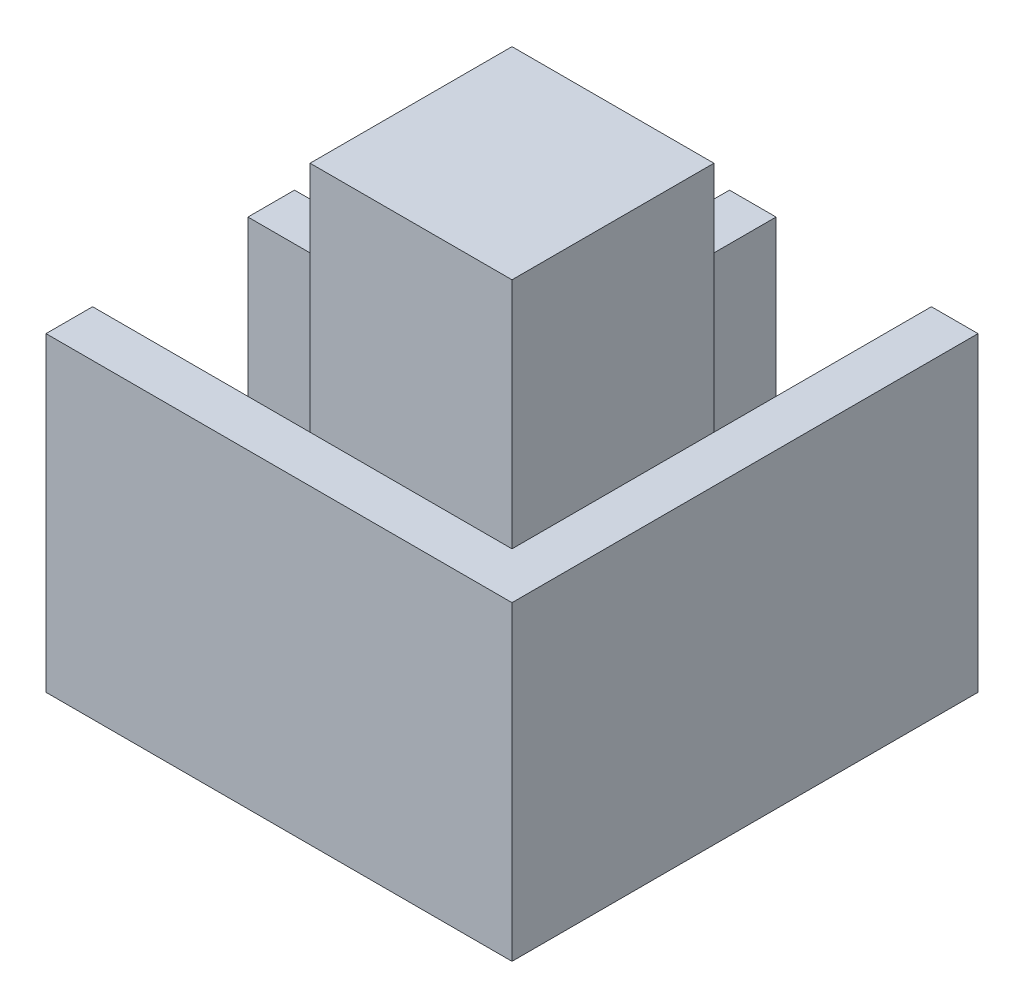
ISO-10303-21;
HEADER;
FILE_DESCRIPTION(('STEP AP214'),'2;1');
FILE_NAME('part.step','',(''),(''),'','','');
FILE_SCHEMA(('AUTOMOTIVE_DESIGN { 1 0 10303 214 1 1 1 1 }'));
ENDSEC;
DATA;
#1=APPLICATION_CONTEXT('core data for automotive mechanical design processes');
#2=APPLICATION_PROTOCOL_DEFINITION('international standard','automotive_design',2000,#1);
#3=PRODUCT_CONTEXT('',#1,'mechanical');
#4=PRODUCT('Part','Part','',(#3));
#5=PRODUCT_RELATED_PRODUCT_CATEGORY('part','',(#4));
#6=PRODUCT_DEFINITION_FORMATION('','',#4);
#7=PRODUCT_DEFINITION_CONTEXT('part definition',#1,'design');
#8=PRODUCT_DEFINITION('design','',#6,#7);
#9=PRODUCT_DEFINITION_SHAPE('','',#8);
#10=(LENGTH_UNIT() NAMED_UNIT(*) SI_UNIT(.MILLI.,.METRE.));
#11=(NAMED_UNIT(*) PLANE_ANGLE_UNIT() SI_UNIT($,.RADIAN.));
#12=(NAMED_UNIT(*) SI_UNIT($,.STERADIAN.) SOLID_ANGLE_UNIT());
#13=UNCERTAINTY_MEASURE_WITH_UNIT(LENGTH_MEASURE(1.E-05),#10,'distance_accuracy_value','');
#14=(GEOMETRIC_REPRESENTATION_CONTEXT(3) GLOBAL_UNCERTAINTY_ASSIGNED_CONTEXT((#13)) GLOBAL_UNIT_ASSIGNED_CONTEXT((#10,
#11,#12)) REPRESENTATION_CONTEXT('',''));
#15=CARTESIAN_POINT('',(0.,0.,0.));
#16=DIRECTION('',(0.,0.,1.));
#17=DIRECTION('',(1.,0.,0.));
#18=AXIS2_PLACEMENT_3D('',#15,#16,#17);
#19=CARTESIAN_POINT('',(0.,0.,0.));
#20=DIRECTION('',(0.,1.,0.));
#21=DIRECTION('',(0.,0.,1.));
#22=AXIS2_PLACEMENT_3D('',#19,#20,#21);
#23=PLANE('',#22);
#24=DIRECTION('',(0.,0.,-1.));
#25=VECTOR('',#24,1.);
#26=CARTESIAN_POINT('',(12.,0.,0.));
#27=LINE('',#26,#25);
#28=CARTESIAN_POINT('',(12.,0.,12.));
#29=VERTEX_POINT('',#28);
#30=CARTESIAN_POINT('',(12.,0.,-1.));
#31=VERTEX_POINT('',#30);
#32=EDGE_CURVE('E227',#29,#31,#27,.T.);
#33=ORIENTED_EDGE('',*,*,#32,.F.);
#34=DIRECTION('',(1.,0.,0.));
#35=VECTOR('',#34,1.);
#36=CARTESIAN_POINT('',(0.,0.,12.));
#37=LINE('',#36,#35);
#38=CARTESIAN_POINT('',(-1.,0.,12.));
#39=VERTEX_POINT('',#38);
#40=EDGE_CURVE('E248',#39,#29,#37,.T.);
#41=ORIENTED_EDGE('',*,*,#40,.F.);
#42=DIRECTION('',(-1.,0.,0.));
#43=VECTOR('',#42,1.);
#44=CARTESIAN_POINT('',(0.,0.,12.));
#45=LINE('',#44,#43);
#46=CARTESIAN_POINT('',(-15.,0.,12.));
#47=VERTEX_POINT('',#46);
#48=EDGE_CURVE('E284',#39,#47,#45,.T.);
#49=ORIENTED_EDGE('',*,*,#48,.T.);
#50=DIRECTION('',(0.,0.,-1.));
#51=VECTOR('',#50,1.);
#52=CARTESIAN_POINT('',(-15.,0.,0.));
#53=LINE('',#52,#51);
#54=CARTESIAN_POINT('',(-15.,0.,15.));
#55=VERTEX_POINT('',#54);
#56=EDGE_CURVE('E330',#55,#47,#53,.T.);
#57=ORIENTED_EDGE('',*,*,#56,.F.);
#58=DIRECTION('',(1.,0.,0.));
#59=VECTOR('',#58,1.);
#60=CARTESIAN_POINT('',(-15.,0.,15.));
#61=LINE('',#60,#59);
#62=CARTESIAN_POINT('',(15.,0.,15.));
#63=VERTEX_POINT('',#62);
#64=EDGE_CURVE('E344',#55,#63,#61,.T.);
#65=ORIENTED_EDGE('',*,*,#64,.T.);
#66=DIRECTION('',(0.,0.,-1.));
#67=VECTOR('',#66,1.);
#68=CARTESIAN_POINT('',(15.,0.,15.));
#69=LINE('',#68,#67);
#70=CARTESIAN_POINT('',(15.,0.,-15.));
#71=VERTEX_POINT('',#70);
#72=EDGE_CURVE('E274',#63,#71,#69,.T.);
#73=ORIENTED_EDGE('',*,*,#72,.T.);
#74=DIRECTION('',(1.,0.,0.));
#75=VECTOR('',#74,1.);
#76=CARTESIAN_POINT('',(0.,0.,-15.));
#77=LINE('',#76,#75);
#78=CARTESIAN_POINT('',(12.,0.,-15.));
#79=VERTEX_POINT('',#78);
#80=EDGE_CURVE('E332',#79,#71,#77,.T.);
#81=ORIENTED_EDGE('',*,*,#80,.F.);
#82=DIRECTION('',(0.,0.,-1.));
#83=VECTOR('',#82,1.);
#84=CARTESIAN_POINT('',(12.,0.,0.));
#85=LINE('',#84,#83);
#86=EDGE_CURVE('E267',#31,#79,#85,.T.);
#87=ORIENTED_EDGE('',*,*,#86,.F.);
#88=EDGE_LOOP('',(#33,#41,#49,#57,#65,#73,#81,#87));
#89=FACE_BOUND('',#88,.T.);
#90=ADVANCED_FACE('F89',(#89),#23,.T.);
#91=DIRECTION('',(-1.,0.,0.));
#92=VECTOR('',#91,1.);
#93=CARTESIAN_POINT('',(0.,0.,2.));
#94=LINE('',#93,#92);
#95=CARTESIAN_POINT('',(-1.,0.,2.));
#96=VERTEX_POINT('',#95);
#97=CARTESIAN_POINT('',(-15.,0.,2.));
#98=VERTEX_POINT('',#97);
#99=EDGE_CURVE('E292',#96,#98,#94,.T.);
#100=ORIENTED_EDGE('',*,*,#99,.F.);
#101=DIRECTION('',(0.,0.,-1.));
#102=VECTOR('',#101,1.);
#103=CARTESIAN_POINT('',(-1.,0.,0.));
#104=LINE('',#103,#102);
#105=CARTESIAN_POINT('',(-1.,0.,-1.));
#106=VERTEX_POINT('',#105);
#107=EDGE_CURVE('E98',#96,#106,#104,.T.);
#108=ORIENTED_EDGE('',*,*,#107,.T.);
#109=DIRECTION('',(-1.,0.,0.));
#110=VECTOR('',#109,1.);
#111=CARTESIAN_POINT('',(0.,0.,-1.));
#112=LINE('',#111,#110);
#113=CARTESIAN_POINT('',(-15.,0.,-1.));
#114=VERTEX_POINT('',#113);
#115=EDGE_CURVE('E234',#106,#114,#112,.T.);
#116=ORIENTED_EDGE('',*,*,#115,.T.);
#117=EDGE_CURVE('E337',#98,#114,#53,.T.);
#118=ORIENTED_EDGE('',*,*,#117,.F.);
#119=EDGE_LOOP('',(#100,#108,#116,#118));
#120=FACE_BOUND('',#119,.T.);
#121=ADVANCED_FACE('F399',(#120),#23,.T.);
#122=DIRECTION('',(-1.,0.,0.));
#123=VECTOR('',#122,1.);
#124=CARTESIAN_POINT('',(0.,0.,-1.));
#125=LINE('',#124,#123);
#126=CARTESIAN_POINT('',(2.,0.,-1.));
#127=VERTEX_POINT('',#126);
#128=EDGE_CURVE('E12',#127,#106,#125,.T.);
#129=ORIENTED_EDGE('',*,*,#128,.F.);
#130=DIRECTION('',(0.,0.,-1.));
#131=VECTOR('',#130,1.);
#132=CARTESIAN_POINT('',(2.,0.,0.));
#133=LINE('',#132,#131);
#134=CARTESIAN_POINT('',(2.,0.,-15.));
#135=VERTEX_POINT('',#134);
#136=EDGE_CURVE('E259',#127,#135,#133,.T.);
#137=ORIENTED_EDGE('',*,*,#136,.T.);
#138=CARTESIAN_POINT('',(-1.,0.,-15.));
#139=VERTEX_POINT('',#138);
#140=EDGE_CURVE('E334',#139,#135,#77,.T.);
#141=ORIENTED_EDGE('',*,*,#140,.F.);
#142=DIRECTION('',(0.,0.,-1.));
#143=VECTOR('',#142,1.);
#144=CARTESIAN_POINT('',(-1.,0.,0.));
#145=LINE('',#144,#143);
#146=EDGE_CURVE('E309',#106,#139,#145,.T.);
#147=ORIENTED_EDGE('',*,*,#146,.F.);
#148=EDGE_LOOP('',(#129,#137,#141,#147));
#149=FACE_BOUND('',#148,.T.);
#150=ADVANCED_FACE('F394',(#149),#23,.T.);
#151=CARTESIAN_POINT('',(-15.,-20.,0.));
#152=DIRECTION('',(1.,0.,0.));
#153=DIRECTION('',(0.,0.,-1.));
#154=AXIS2_PLACEMENT_3D('',#151,#152,#153);
#155=PLANE('',#154);
#156=DIRECTION('',(0.,1.,0.));
#157=VECTOR('',#156,1.);
#158=CARTESIAN_POINT('',(-15.,-15.,12.));
#159=LINE('',#158,#157);
#160=CARTESIAN_POINT('',(-15.,-15.,12.));
#161=VERTEX_POINT('',#160);
#162=EDGE_CURVE('E298',#161,#47,#159,.T.);
#163=ORIENTED_EDGE('',*,*,#162,.F.);
#164=DIRECTION('',(0.,0.,-1.));
#165=VECTOR('',#164,1.);
#166=CARTESIAN_POINT('',(-15.,-15.,0.));
#167=LINE('',#166,#165);
#168=CARTESIAN_POINT('',(-15.,-15.,2.));
#169=VERTEX_POINT('',#168);
#170=EDGE_CURVE('E286',#161,#169,#167,.T.);
#171=ORIENTED_EDGE('',*,*,#170,.T.);
#172=DIRECTION('',(0.,1.,0.));
#173=VECTOR('',#172,1.);
#174=CARTESIAN_POINT('',(-15.,-15.,2.));
#175=LINE('',#174,#173);
#176=EDGE_CURVE('E300',#169,#98,#175,.T.);
#177=ORIENTED_EDGE('',*,*,#176,.T.);
#178=ORIENTED_EDGE('',*,*,#117,.T.);
#179=DIRECTION('',(0.,1.,0.));
#180=VECTOR('',#179,1.);
#181=CARTESIAN_POINT('',(-15.,-15.,-1.));
#182=LINE('',#181,#180);
#183=CARTESIAN_POINT('',(-15.,-15.,-1.));
#184=VERTEX_POINT('',#183);
#185=EDGE_CURVE('E294',#184,#114,#182,.T.);
#186=ORIENTED_EDGE('',*,*,#185,.F.);
#187=DIRECTION('',(0.,0.,-1.));
#188=VECTOR('',#187,1.);
#189=CARTESIAN_POINT('',(-15.,-15.,0.));
#190=LINE('',#189,#188);
#191=CARTESIAN_POINT('',(-15.,-15.,-15.));
#192=VERTEX_POINT('',#191);
#193=EDGE_CURVE('E314',#184,#192,#190,.T.);
#194=ORIENTED_EDGE('',*,*,#193,.T.);
#195=DIRECTION('',(0.,1.,0.));
#196=VECTOR('',#195,1.);
#197=CARTESIAN_POINT('',(-15.,-20.,-15.));
#198=LINE('',#197,#196);
#199=CARTESIAN_POINT('',(-15.,-20.,-15.));
#200=VERTEX_POINT('',#199);
#201=EDGE_CURVE('E247',#200,#192,#198,.T.);
#202=ORIENTED_EDGE('',*,*,#201,.F.);
#203=DIRECTION('',(0.,0.,-1.));
#204=VECTOR('',#203,1.);
#205=CARTESIAN_POINT('',(-15.,-20.,0.));
#206=LINE('',#205,#204);
#207=CARTESIAN_POINT('',(-15.,-20.,15.));
#208=VERTEX_POINT('',#207);
#209=EDGE_CURVE('E329',#208,#200,#206,.T.);
#210=ORIENTED_EDGE('',*,*,#209,.F.);
#211=DIRECTION('',(0.,1.,0.));
#212=VECTOR('',#211,1.);
#213=CARTESIAN_POINT('',(-15.,-20.,15.));
#214=LINE('',#213,#212);
#215=EDGE_CURVE('E347',#208,#55,#214,.T.);
#216=ORIENTED_EDGE('',*,*,#215,.T.);
#217=ORIENTED_EDGE('',*,*,#56,.T.);
#218=EDGE_LOOP('',(#163,#171,#177,#178,#186,#194,#202,#210,#216,#217));
#219=FACE_BOUND('',#218,.T.);
#220=ADVANCED_FACE('F377',(#219),#155,.F.);
#221=CARTESIAN_POINT('',(0.,-20.,-15.));
#222=DIRECTION('',(0.,0.,1.));
#223=DIRECTION('',(1.,0.,0.));
#224=AXIS2_PLACEMENT_3D('',#221,#222,#223);
#225=PLANE('',#224);
#226=DIRECTION('',(0.,1.,0.));
#227=VECTOR('',#226,1.);
#228=CARTESIAN_POINT('',(2.,-15.,-15.));
#229=LINE('',#228,#227);
#230=CARTESIAN_POINT('',(2.,-15.,-15.));
#231=VERTEX_POINT('',#230);
#232=EDGE_CURVE('E275',#231,#135,#229,.T.);
#233=ORIENTED_EDGE('',*,*,#232,.F.);
#234=DIRECTION('',(1.,0.,0.));
#235=VECTOR('',#234,1.);
#236=CARTESIAN_POINT('',(0.,-15.,-15.));
#237=LINE('',#236,#235);
#238=CARTESIAN_POINT('',(12.,-15.,-15.));
#239=VERTEX_POINT('',#238);
#240=EDGE_CURVE('E261',#231,#239,#237,.T.);
#241=ORIENTED_EDGE('',*,*,#240,.T.);
#242=DIRECTION('',(0.,1.,0.));
#243=VECTOR('',#242,1.);
#244=CARTESIAN_POINT('',(12.,-15.,-15.));
#245=LINE('',#244,#243);
#246=EDGE_CURVE('E277',#239,#79,#245,.T.);
#247=ORIENTED_EDGE('',*,*,#246,.T.);
#248=ORIENTED_EDGE('',*,*,#80,.T.);
#249=DIRECTION('',(0.,1.,0.));
#250=VECTOR('',#249,1.);
#251=CARTESIAN_POINT('',(15.,-20.,-15.));
#252=LINE('',#251,#250);
#253=CARTESIAN_POINT('',(15.,-20.,-15.));
#254=VERTEX_POINT('',#253);
#255=EDGE_CURVE('E93',#254,#71,#252,.T.);
#256=ORIENTED_EDGE('',*,*,#255,.F.);
#257=DIRECTION('',(1.,0.,0.));
#258=VECTOR('',#257,1.);
#259=CARTESIAN_POINT('',(0.,-20.,-15.));
#260=LINE('',#259,#258);
#261=EDGE_CURVE('E327',#200,#254,#260,.T.);
#262=ORIENTED_EDGE('',*,*,#261,.F.);
#263=ORIENTED_EDGE('',*,*,#201,.T.);
#264=DIRECTION('',(1.,0.,0.));
#265=VECTOR('',#264,1.);
#266=CARTESIAN_POINT('',(0.,-15.,-15.));
#267=LINE('',#266,#265);
#268=CARTESIAN_POINT('',(-1.,-15.,-15.));
#269=VERTEX_POINT('',#268);
#270=EDGE_CURVE('E311',#192,#269,#267,.T.);
#271=ORIENTED_EDGE('',*,*,#270,.T.);
#272=DIRECTION('',(0.,1.,0.));
#273=VECTOR('',#272,1.);
#274=CARTESIAN_POINT('',(-1.,-15.,-15.));
#275=LINE('',#274,#273);
#276=EDGE_CURVE('E322',#269,#139,#275,.T.);
#277=ORIENTED_EDGE('',*,*,#276,.T.);
#278=ORIENTED_EDGE('',*,*,#140,.T.);
#279=EDGE_LOOP('',(#233,#241,#247,#248,#256,#262,#263,#271,#277,#278));
#280=FACE_BOUND('',#279,.T.);
#281=ADVANCED_FACE('F375',(#280),#225,.F.);
#282=CARTESIAN_POINT('',(0.,-20.,0.));
#283=DIRECTION('',(0.,1.,0.));
#284=DIRECTION('',(0.,0.,1.));
#285=AXIS2_PLACEMENT_3D('',#282,#283,#284);
#286=PLANE('',#285);
#287=DIRECTION('',(1.,0.,0.));
#288=VECTOR('',#287,1.);
#289=CARTESIAN_POINT('',(-15.,-20.,15.));
#290=LINE('',#289,#288);
#291=CARTESIAN_POINT('',(15.,-20.,15.));
#292=VERTEX_POINT('',#291);
#293=EDGE_CURVE('E343',#208,#292,#290,.T.);
#294=ORIENTED_EDGE('',*,*,#293,.F.);
#295=ORIENTED_EDGE('',*,*,#209,.T.);
#296=ORIENTED_EDGE('',*,*,#261,.T.);
#297=DIRECTION('',(0.,0.,-1.));
#298=VECTOR('',#297,1.);
#299=CARTESIAN_POINT('',(15.,-20.,15.));
#300=LINE('',#299,#298);
#301=EDGE_CURVE('E340',#292,#254,#300,.T.);
#302=ORIENTED_EDGE('',*,*,#301,.F.);
#303=EDGE_LOOP('',(#294,#295,#296,#302));
#304=FACE_BOUND('',#303,.T.);
#305=ADVANCED_FACE('F372',(#304),#286,.F.);
#306=CARTESIAN_POINT('',(15.,-20.,15.));
#307=DIRECTION('',(1.,0.,0.));
#308=DIRECTION('',(0.,0.,-1.));
#309=AXIS2_PLACEMENT_3D('',#306,#307,#308);
#310=PLANE('',#309);
#311=ORIENTED_EDGE('',*,*,#72,.F.);
#312=DIRECTION('',(0.,1.,0.));
#313=VECTOR('',#312,1.);
#314=CARTESIAN_POINT('',(15.,-20.,15.));
#315=LINE('',#314,#313);
#316=EDGE_CURVE('E353',#292,#63,#315,.T.);
#317=ORIENTED_EDGE('',*,*,#316,.F.);
#318=ORIENTED_EDGE('',*,*,#301,.T.);
#319=ORIENTED_EDGE('',*,*,#255,.T.);
#320=EDGE_LOOP('',(#311,#317,#318,#319));
#321=FACE_BOUND('',#320,.T.);
#322=ADVANCED_FACE('F91',(#321),#310,.T.);
#323=CARTESIAN_POINT('',(-15.,-20.,15.));
#324=DIRECTION('',(0.,0.,1.));
#325=DIRECTION('',(1.,0.,0.));
#326=AXIS2_PLACEMENT_3D('',#323,#324,#325);
#327=PLANE('',#326);
#328=ORIENTED_EDGE('',*,*,#64,.F.);
#329=ORIENTED_EDGE('',*,*,#215,.F.);
#330=ORIENTED_EDGE('',*,*,#293,.T.);
#331=ORIENTED_EDGE('',*,*,#316,.T.);
#332=EDGE_LOOP('',(#328,#329,#330,#331));
#333=FACE_BOUND('',#332,.T.);
#334=ADVANCED_FACE('F368',(#333),#327,.T.);
#335=CARTESIAN_POINT('',(0.,-15.,-1.));
#336=DIRECTION('',(0.,0.,-1.));
#337=DIRECTION('',(-1.,0.,0.));
#338=AXIS2_PLACEMENT_3D('',#335,#336,#337);
#339=PLANE('',#338);
#340=ORIENTED_EDGE('',*,*,#115,.F.);
#341=DIRECTION('',(0.,1.,0.));
#342=VECTOR('',#341,1.);
#343=CARTESIAN_POINT('',(-1.,-15.,-1.));
#344=LINE('',#343,#342);
#345=CARTESIAN_POINT('',(-1.,-15.,-1.));
#346=VERTEX_POINT('',#345);
#347=EDGE_CURVE('E317',#346,#106,#344,.T.);
#348=ORIENTED_EDGE('',*,*,#347,.F.);
#349=DIRECTION('',(-1.,0.,0.));
#350=VECTOR('',#349,1.);
#351=CARTESIAN_POINT('',(0.,-15.,-1.));
#352=LINE('',#351,#350);
#353=EDGE_CURVE('E305',#346,#184,#352,.T.);
#354=ORIENTED_EDGE('',*,*,#353,.T.);
#355=ORIENTED_EDGE('',*,*,#185,.T.);
#356=EDGE_LOOP('',(#340,#348,#354,#355));
#357=FACE_BOUND('',#356,.T.);
#358=ADVANCED_FACE('F386',(#357),#339,.T.);
#359=CARTESIAN_POINT('',(-1.,-15.,0.));
#360=DIRECTION('',(1.,0.,0.));
#361=DIRECTION('',(0.,0.,-1.));
#362=AXIS2_PLACEMENT_3D('',#359,#360,#361);
#363=PLANE('',#362);
#364=ORIENTED_EDGE('',*,*,#146,.T.);
#365=ORIENTED_EDGE('',*,*,#276,.F.);
#366=DIRECTION('',(0.,0.,-1.));
#367=VECTOR('',#366,1.);
#368=CARTESIAN_POINT('',(-1.,-15.,0.));
#369=LINE('',#368,#367);
#370=EDGE_CURVE('E308',#346,#269,#369,.T.);
#371=ORIENTED_EDGE('',*,*,#370,.F.);
#372=ORIENTED_EDGE('',*,*,#347,.T.);
#373=EDGE_LOOP('',(#364,#365,#371,#372));
#374=FACE_BOUND('',#373,.T.);
#375=ADVANCED_FACE('F389',(#374),#363,.F.);
#376=CARTESIAN_POINT('',(0.,-15.,0.));
#377=DIRECTION('',(0.,1.,0.));
#378=DIRECTION('',(0.,0.,1.));
#379=AXIS2_PLACEMENT_3D('',#376,#377,#378);
#380=PLANE('',#379);
#381=ORIENTED_EDGE('',*,*,#353,.F.);
#382=ORIENTED_EDGE('',*,*,#370,.T.);
#383=ORIENTED_EDGE('',*,*,#270,.F.);
#384=ORIENTED_EDGE('',*,*,#193,.F.);
#385=EDGE_LOOP('',(#381,#382,#383,#384));
#386=FACE_BOUND('',#385,.T.);
#387=ADVANCED_FACE('F382',(#386),#380,.T.);
#388=CARTESIAN_POINT('',(0.,-15.,-1.));
#389=DIRECTION('',(0.,0.,-1.));
#390=DIRECTION('',(-1.,0.,0.));
#391=AXIS2_PLACEMENT_3D('',#388,#389,#390);
#392=PLANE('',#391);
#393=DIRECTION('',(0.,1.,0.));
#394=VECTOR('',#393,1.);
#395=CARTESIAN_POINT('',(2.,-15.,-1.));
#396=LINE('',#395,#394);
#397=CARTESIAN_POINT('',(2.,-15.,-1.));
#398=VERTEX_POINT('',#397);
#399=EDGE_CURVE('E272',#398,#127,#396,.T.);
#400=ORIENTED_EDGE('',*,*,#399,.T.);
#401=ORIENTED_EDGE('',*,*,#128,.T.);
#402=DIRECTION('',(0.,-1.,0.));
#403=VECTOR('',#402,1.);
#404=CARTESIAN_POINT('',(-1.,15.,-1.));
#405=LINE('',#404,#403);
#406=CARTESIAN_POINT('',(-1.,15.,-1.));
#407=VERTEX_POINT('',#406);
#408=EDGE_CURVE('E229',#407,#106,#405,.T.);
#409=ORIENTED_EDGE('',*,*,#408,.F.);
#410=DIRECTION('',(-1.,0.,0.));
#411=VECTOR('',#410,1.);
#412=CARTESIAN_POINT('',(0.,15.,-1.));
#413=LINE('',#412,#411);
#414=CARTESIAN_POINT('',(12.,15.,-1.));
#415=VERTEX_POINT('',#414);
#416=EDGE_CURVE('E217',#415,#407,#413,.T.);
#417=ORIENTED_EDGE('',*,*,#416,.F.);
#418=DIRECTION('',(0.,-1.,0.));
#419=VECTOR('',#418,1.);
#420=CARTESIAN_POINT('',(12.,15.,-1.));
#421=LINE('',#420,#419);
#422=EDGE_CURVE('E244',#415,#31,#421,.T.);
#423=ORIENTED_EDGE('',*,*,#422,.T.);
#424=DIRECTION('',(0.,1.,0.));
#425=VECTOR('',#424,1.);
#426=CARTESIAN_POINT('',(12.,-15.,-1.));
#427=LINE('',#426,#425);
#428=CARTESIAN_POINT('',(12.,-15.,-1.));
#429=VERTEX_POINT('',#428);
#430=EDGE_CURVE('E266',#429,#31,#427,.T.);
#431=ORIENTED_EDGE('',*,*,#430,.F.);
#432=DIRECTION('',(-1.,0.,0.));
#433=VECTOR('',#432,1.);
#434=CARTESIAN_POINT('',(0.,-15.,-1.));
#435=LINE('',#434,#433);
#436=EDGE_CURVE('E256',#429,#398,#435,.T.);
#437=ORIENTED_EDGE('',*,*,#436,.T.);
#438=EDGE_LOOP('',(#400,#401,#409,#417,#423,#431,#437));
#439=FACE_BOUND('',#438,.T.);
#440=ADVANCED_FACE('F231',(#439),#392,.T.);
#441=CARTESIAN_POINT('',(2.,-15.,0.));
#442=DIRECTION('',(1.,0.,0.));
#443=DIRECTION('',(0.,0.,-1.));
#444=AXIS2_PLACEMENT_3D('',#441,#442,#443);
#445=PLANE('',#444);
#446=ORIENTED_EDGE('',*,*,#136,.F.);
#447=ORIENTED_EDGE('',*,*,#399,.F.);
#448=DIRECTION('',(0.,0.,-1.));
#449=VECTOR('',#448,1.);
#450=CARTESIAN_POINT('',(2.,-15.,0.));
#451=LINE('',#450,#449);
#452=EDGE_CURVE('E264',#398,#231,#451,.T.);
#453=ORIENTED_EDGE('',*,*,#452,.T.);
#454=ORIENTED_EDGE('',*,*,#232,.T.);
#455=EDGE_LOOP('',(#446,#447,#453,#454));
#456=FACE_BOUND('',#455,.T.);
#457=ADVANCED_FACE('F419',(#456),#445,.T.);
#458=CARTESIAN_POINT('',(12.,-15.,0.));
#459=DIRECTION('',(1.,0.,0.));
#460=DIRECTION('',(0.,0.,-1.));
#461=AXIS2_PLACEMENT_3D('',#458,#459,#460);
#462=PLANE('',#461);
#463=ORIENTED_EDGE('',*,*,#86,.T.);
#464=ORIENTED_EDGE('',*,*,#246,.F.);
#465=DIRECTION('',(0.,0.,-1.));
#466=VECTOR('',#465,1.);
#467=CARTESIAN_POINT('',(12.,-15.,0.));
#468=LINE('',#467,#466);
#469=EDGE_CURVE('E114',#429,#239,#468,.T.);
#470=ORIENTED_EDGE('',*,*,#469,.F.);
#471=ORIENTED_EDGE('',*,*,#430,.T.);
#472=EDGE_LOOP('',(#463,#464,#470,#471));
#473=FACE_BOUND('',#472,.T.);
#474=ADVANCED_FACE('F415',(#473),#462,.F.);
#475=CARTESIAN_POINT('',(0.,-15.,0.));
#476=DIRECTION('',(0.,1.,0.));
#477=DIRECTION('',(0.,0.,1.));
#478=AXIS2_PLACEMENT_3D('',#475,#476,#477);
#479=PLANE('',#478);
#480=ORIENTED_EDGE('',*,*,#436,.F.);
#481=ORIENTED_EDGE('',*,*,#469,.T.);
#482=ORIENTED_EDGE('',*,*,#240,.F.);
#483=ORIENTED_EDGE('',*,*,#452,.F.);
#484=EDGE_LOOP('',(#480,#481,#482,#483));
#485=FACE_BOUND('',#484,.T.);
#486=ADVANCED_FACE('F416',(#485),#479,.T.);
#487=CARTESIAN_POINT('',(-1.,-15.,0.));
#488=DIRECTION('',(1.,0.,0.));
#489=DIRECTION('',(0.,0.,-1.));
#490=AXIS2_PLACEMENT_3D('',#487,#488,#489);
#491=PLANE('',#490);
#492=DIRECTION('',(0.,1.,0.));
#493=VECTOR('',#492,1.);
#494=CARTESIAN_POINT('',(-1.,-15.,12.));
#495=LINE('',#494,#493);
#496=CARTESIAN_POINT('',(-1.,-15.,12.));
#497=VERTEX_POINT('',#496);
#498=EDGE_CURVE('E269',#497,#39,#495,.T.);
#499=ORIENTED_EDGE('',*,*,#498,.T.);
#500=DIRECTION('',(0.,-1.,0.));
#501=VECTOR('',#500,1.);
#502=CARTESIAN_POINT('',(-1.,15.,12.));
#503=LINE('',#502,#501);
#504=CARTESIAN_POINT('',(-1.,15.,12.));
#505=VERTEX_POINT('',#504);
#506=EDGE_CURVE('E235',#505,#39,#503,.T.);
#507=ORIENTED_EDGE('',*,*,#506,.F.);
#508=DIRECTION('',(0.,0.,-1.));
#509=VECTOR('',#508,1.);
#510=CARTESIAN_POINT('',(-1.,15.,0.));
#511=LINE('',#510,#509);
#512=EDGE_CURVE('E221',#505,#407,#511,.T.);
#513=ORIENTED_EDGE('',*,*,#512,.T.);
#514=ORIENTED_EDGE('',*,*,#408,.T.);
#515=ORIENTED_EDGE('',*,*,#107,.F.);
#516=DIRECTION('',(0.,1.,0.));
#517=VECTOR('',#516,1.);
#518=CARTESIAN_POINT('',(-1.,-15.,2.));
#519=LINE('',#518,#517);
#520=CARTESIAN_POINT('',(-1.,-15.,2.));
#521=VERTEX_POINT('',#520);
#522=EDGE_CURVE('E291',#521,#96,#519,.T.);
#523=ORIENTED_EDGE('',*,*,#522,.F.);
#524=DIRECTION('',(0.,0.,-1.));
#525=VECTOR('',#524,1.);
#526=CARTESIAN_POINT('',(-1.,-15.,0.));
#527=LINE('',#526,#525);
#528=EDGE_CURVE('E282',#497,#521,#527,.T.);
#529=ORIENTED_EDGE('',*,*,#528,.F.);
#530=EDGE_LOOP('',(#499,#507,#513,#514,#515,#523,#529));
#531=FACE_BOUND('',#530,.T.);
#532=ADVANCED_FACE('F238',(#531),#491,.F.);
#533=CARTESIAN_POINT('',(0.,-15.,12.));
#534=DIRECTION('',(0.,0.,-1.));
#535=DIRECTION('',(-1.,0.,0.));
#536=AXIS2_PLACEMENT_3D('',#533,#534,#535);
#537=PLANE('',#536);
#538=ORIENTED_EDGE('',*,*,#48,.F.);
#539=ORIENTED_EDGE('',*,*,#498,.F.);
#540=DIRECTION('',(-1.,0.,0.));
#541=VECTOR('',#540,1.);
#542=CARTESIAN_POINT('',(0.,-15.,12.));
#543=LINE('',#542,#541);
#544=EDGE_CURVE('E289',#497,#161,#543,.T.);
#545=ORIENTED_EDGE('',*,*,#544,.T.);
#546=ORIENTED_EDGE('',*,*,#162,.T.);
#547=EDGE_LOOP('',(#538,#539,#545,#546));
#548=FACE_BOUND('',#547,.T.);
#549=ADVANCED_FACE('F407',(#548),#537,.T.);
#550=CARTESIAN_POINT('',(0.,-15.,2.));
#551=DIRECTION('',(0.,0.,-1.));
#552=DIRECTION('',(-1.,0.,0.));
#553=AXIS2_PLACEMENT_3D('',#550,#551,#552);
#554=PLANE('',#553);
#555=ORIENTED_EDGE('',*,*,#99,.T.);
#556=ORIENTED_EDGE('',*,*,#176,.F.);
#557=DIRECTION('',(-1.,0.,0.));
#558=VECTOR('',#557,1.);
#559=CARTESIAN_POINT('',(0.,-15.,2.));
#560=LINE('',#559,#558);
#561=EDGE_CURVE('E106',#521,#169,#560,.T.);
#562=ORIENTED_EDGE('',*,*,#561,.F.);
#563=ORIENTED_EDGE('',*,*,#522,.T.);
#564=EDGE_LOOP('',(#555,#556,#562,#563));
#565=FACE_BOUND('',#564,.T.);
#566=ADVANCED_FACE('F402',(#565),#554,.F.);
#567=CARTESIAN_POINT('',(0.,-15.,0.));
#568=DIRECTION('',(0.,1.,0.));
#569=DIRECTION('',(0.,0.,1.));
#570=AXIS2_PLACEMENT_3D('',#567,#568,#569);
#571=PLANE('',#570);
#572=ORIENTED_EDGE('',*,*,#528,.T.);
#573=ORIENTED_EDGE('',*,*,#561,.T.);
#574=ORIENTED_EDGE('',*,*,#170,.F.);
#575=ORIENTED_EDGE('',*,*,#544,.F.);
#576=EDGE_LOOP('',(#572,#573,#574,#575));
#577=FACE_BOUND('',#576,.T.);
#578=ADVANCED_FACE('F404',(#577),#571,.T.);
#579=CARTESIAN_POINT('',(0.,15.,12.));
#580=DIRECTION('',(0.,0.,-1.));
#581=DIRECTION('',(-1.,0.,0.));
#582=AXIS2_PLACEMENT_3D('',#579,#580,#581);
#583=PLANE('',#582);
#584=ORIENTED_EDGE('',*,*,#40,.T.);
#585=DIRECTION('',(0.,-1.,0.));
#586=VECTOR('',#585,1.);
#587=CARTESIAN_POINT('',(12.,15.,12.));
#588=LINE('',#587,#586);
#589=CARTESIAN_POINT('',(12.,15.,12.));
#590=VERTEX_POINT('',#589);
#591=EDGE_CURVE('E252',#590,#29,#588,.T.);
#592=ORIENTED_EDGE('',*,*,#591,.F.);
#593=DIRECTION('',(1.,0.,0.));
#594=VECTOR('',#593,1.);
#595=CARTESIAN_POINT('',(0.,15.,12.));
#596=LINE('',#595,#594);
#597=EDGE_CURVE('E240',#505,#590,#596,.T.);
#598=ORIENTED_EDGE('',*,*,#597,.F.);
#599=ORIENTED_EDGE('',*,*,#506,.T.);
#600=EDGE_LOOP('',(#584,#592,#598,#599));
#601=FACE_BOUND('',#600,.T.);
#602=ADVANCED_FACE('F411',(#601),#583,.F.);
#603=CARTESIAN_POINT('',(12.,15.,0.));
#604=DIRECTION('',(-1.,0.,0.));
#605=DIRECTION('',(0.,0.,1.));
#606=AXIS2_PLACEMENT_3D('',#603,#604,#605);
#607=PLANE('',#606);
#608=ORIENTED_EDGE('',*,*,#32,.T.);
#609=ORIENTED_EDGE('',*,*,#422,.F.);
#610=DIRECTION('',(0.,0.,-1.));
#611=VECTOR('',#610,1.);
#612=CARTESIAN_POINT('',(12.,15.,0.));
#613=LINE('',#612,#611);
#614=EDGE_CURVE('E223',#590,#415,#613,.T.);
#615=ORIENTED_EDGE('',*,*,#614,.F.);
#616=ORIENTED_EDGE('',*,*,#591,.T.);
#617=EDGE_LOOP('',(#608,#609,#615,#616));
#618=FACE_BOUND('',#617,.T.);
#619=ADVANCED_FACE('F413',(#618),#607,.F.);
#620=CARTESIAN_POINT('',(0.,15.,0.));
#621=DIRECTION('',(0.,1.,0.));
#622=DIRECTION('',(0.,0.,1.));
#623=AXIS2_PLACEMENT_3D('',#620,#621,#622);
#624=PLANE('',#623);
#625=ORIENTED_EDGE('',*,*,#416,.T.);
#626=ORIENTED_EDGE('',*,*,#512,.F.);
#627=ORIENTED_EDGE('',*,*,#597,.T.);
#628=ORIENTED_EDGE('',*,*,#614,.T.);
#629=EDGE_LOOP('',(#625,#626,#627,#628));
#630=FACE_BOUND('',#629,.T.);
#631=ADVANCED_FACE('F219',(#630),#624,.T.);
#632=CLOSED_SHELL('',(#90,#121,#150,#220,#281,#305,#322,#334,#358,#375,#387,#440,#457,#474,#486,
#532,#549,#566,#578,#602,#619,#631));
#633=MANIFOLD_SOLID_BREP('B2',#632);
#634=ADVANCED_BREP_SHAPE_REPRESENTATION('',(#18,#633),#14);
#635=SHAPE_DEFINITION_REPRESENTATION(#9,#634);
ENDSEC;
END-ISO-10303-21;
